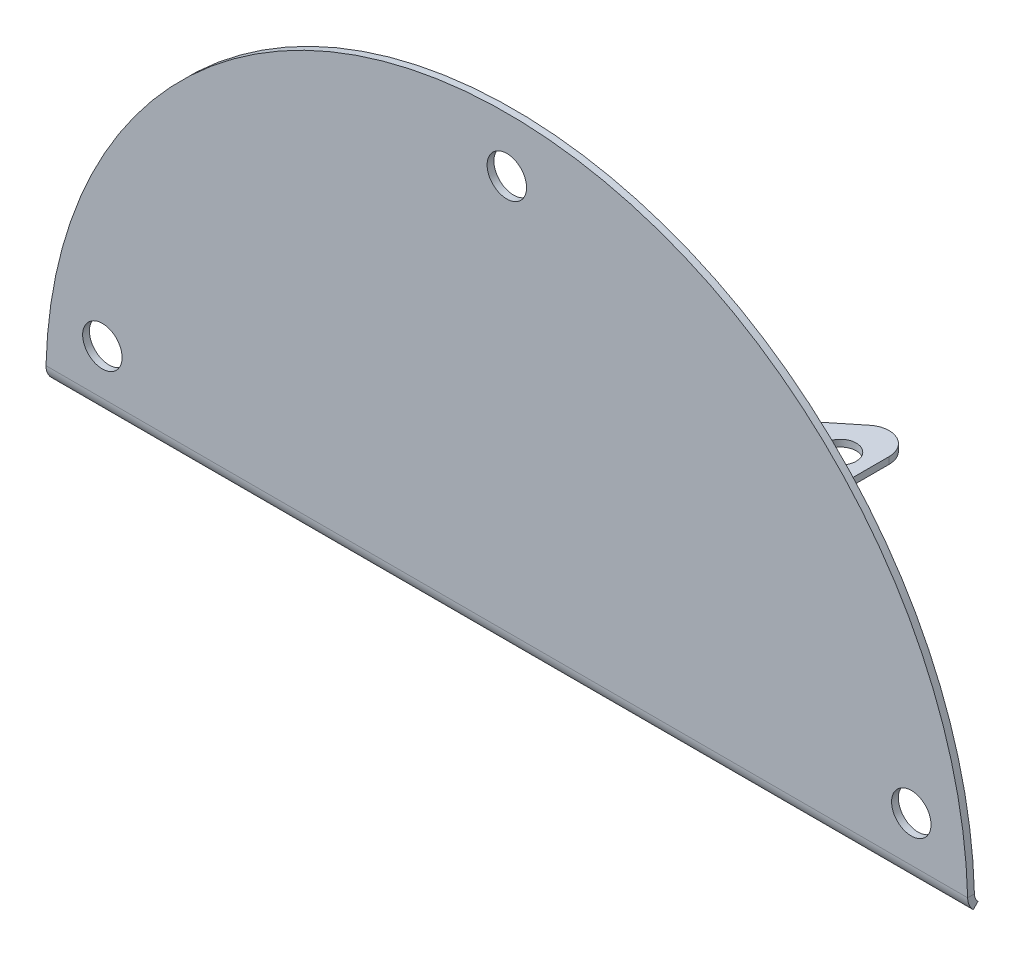
ISO-10303-21;
HEADER;
FILE_DESCRIPTION(('STEP AP214'),'2;1');
FILE_NAME('part.step','',(''),(''),'','','');
FILE_SCHEMA(('AUTOMOTIVE_DESIGN { 1 0 10303 214 1 1 1 1 }'));
ENDSEC;
DATA;
#1=APPLICATION_CONTEXT('core data for automotive mechanical design processes');
#2=APPLICATION_PROTOCOL_DEFINITION('international standard','automotive_design',2000,#1);
#3=PRODUCT_CONTEXT('',#1,'mechanical');
#4=PRODUCT('Part','Part','',(#3));
#5=PRODUCT_RELATED_PRODUCT_CATEGORY('part','',(#4));
#6=PRODUCT_DEFINITION_FORMATION('','',#4);
#7=PRODUCT_DEFINITION_CONTEXT('part definition',#1,'design');
#8=PRODUCT_DEFINITION('design','',#6,#7);
#9=PRODUCT_DEFINITION_SHAPE('','',#8);
#10=(LENGTH_UNIT() NAMED_UNIT(*) SI_UNIT(.MILLI.,.METRE.));
#11=(NAMED_UNIT(*) PLANE_ANGLE_UNIT() SI_UNIT($,.RADIAN.));
#12=(NAMED_UNIT(*) SI_UNIT($,.STERADIAN.) SOLID_ANGLE_UNIT());
#13=UNCERTAINTY_MEASURE_WITH_UNIT(LENGTH_MEASURE(1.E-05),#10,'distance_accuracy_value','');
#14=(GEOMETRIC_REPRESENTATION_CONTEXT(3) GLOBAL_UNCERTAINTY_ASSIGNED_CONTEXT((#13)) GLOBAL_UNIT_ASSIGNED_CONTEXT((#10,
#11,#12)) REPRESENTATION_CONTEXT('',''));
#15=CARTESIAN_POINT('',(0.,0.,0.));
#16=DIRECTION('',(0.,0.,1.));
#17=DIRECTION('',(1.,0.,0.));
#18=AXIS2_PLACEMENT_3D('',#15,#16,#17);
#19=CARTESIAN_POINT('',(0.,-0.0420352248333679,0.600000000000007));
#20=DIRECTION('',(0.,0.,-1.));
#21=DIRECTION('',(0.,1.,0.));
#22=AXIS2_PLACEMENT_3D('',#19,#20,#21);
#23=PLANE('',#22);
#24=DIRECTION('',(-1.,0.,0.));
#25=VECTOR('',#24,1.);
#26=CARTESIAN_POINT('',(0.,1.00000000000001,0.600000000000003));
#27=LINE('',#26,#25);
#28=CARTESIAN_POINT('',(40.8867235492184,1.00000000000001,0.600000000000003));
#29=VERTEX_POINT('',#28);
#30=CARTESIAN_POINT('',(-40.8867235492184,1.00000000000001,0.600000000000004));
#31=VERTEX_POINT('',#30);
#32=EDGE_CURVE('E135',#29,#31,#27,.T.);
#33=ORIENTED_EDGE('',*,*,#32,.F.);
#34=CARTESIAN_POINT('',(0.,-0.0420352248333679,0.600000000000007));
#35=DIRECTION('',(0.,0.,-1.));
#36=DIRECTION('',(0.,1.,0.));
#37=AXIS2_PLACEMENT_3D('',#34,#35,#36);
#38=CIRCLE('',#37,40.9);
#39=EDGE_CURVE('E391',#31,#29,#38,.T.);
#40=ORIENTED_EDGE('',*,*,#39,.F.);
#41=EDGE_LOOP('',(#33,#40));
#42=FACE_BOUND('',#41,.T.);
#43=CARTESIAN_POINT('',(0.,36.,0.59999999999988));
#44=DIRECTION('',(0.,0.,-1.));
#45=DIRECTION('',(0.,1.,0.));
#46=AXIS2_PLACEMENT_3D('',#43,#44,#45);
#47=CIRCLE('',#46,1.75);
#48=CARTESIAN_POINT('',(0.,37.75,0.599999999999874));
#49=VERTEX_POINT('',#48);
#50=EDGE_CURVE('E408',#49,#49,#47,.T.);
#51=ORIENTED_EDGE('',*,*,#50,.T.);
#52=EDGE_LOOP('',(#51));
#53=FACE_BOUND('',#52,.T.);
#54=CARTESIAN_POINT('',(-35.8867235492184,5.00000000000001,0.599999999999989));
#55=DIRECTION('',(0.,0.,-1.));
#56=DIRECTION('',(0.,1.,0.));
#57=AXIS2_PLACEMENT_3D('',#54,#55,#56);
#58=CIRCLE('',#57,1.75);
#59=CARTESIAN_POINT('',(-35.8867235492184,6.75000000000001,0.599999999999983));
#60=VERTEX_POINT('',#59);
#61=EDGE_CURVE('E644',#60,#60,#58,.T.);
#62=ORIENTED_EDGE('',*,*,#61,.T.);
#63=EDGE_LOOP('',(#62));
#64=FACE_BOUND('',#63,.T.);
#65=CARTESIAN_POINT('',(35.8867235492184,5.00000000000001,0.599999999999989));
#66=DIRECTION('',(0.,0.,-1.));
#67=DIRECTION('',(0.,1.,0.));
#68=AXIS2_PLACEMENT_3D('',#65,#66,#67);
#69=CIRCLE('',#68,1.75);
#70=CARTESIAN_POINT('',(35.8867235492184,6.75000000000001,0.599999999999983));
#71=VERTEX_POINT('',#70);
#72=EDGE_CURVE('E639',#71,#71,#69,.F.);
#73=ORIENTED_EDGE('',*,*,#72,.F.);
#74=EDGE_LOOP('',(#73));
#75=FACE_BOUND('',#74,.T.);
#76=ADVANCED_FACE('F60',(#42,#53,#64,#75),#23,.F.);
#77=CARTESIAN_POINT('',(0.,-0.04203522483337,0.));
#78=DIRECTION('',(0.,0.,-1.));
#79=DIRECTION('',(0.,1.,0.));
#80=AXIS2_PLACEMENT_3D('',#77,#78,#79);
#81=PLANE('',#80);
#82=CARTESIAN_POINT('',(0.,-0.04203522483337,0.));
#83=DIRECTION('',(0.,0.,-1.));
#84=DIRECTION('',(0.,1.,0.));
#85=AXIS2_PLACEMENT_3D('',#82,#83,#84);
#86=CIRCLE('',#85,40.9);
#87=CARTESIAN_POINT('',(-40.8867235492184,1.,0.));
#88=VERTEX_POINT('',#87);
#89=CARTESIAN_POINT('',(40.8867235492184,1.,0.));
#90=VERTEX_POINT('',#89);
#91=EDGE_CURVE('E384',#88,#90,#86,.T.);
#92=ORIENTED_EDGE('',*,*,#91,.T.);
#93=DIRECTION('',(-1.,0.,0.));
#94=VECTOR('',#93,1.);
#95=CARTESIAN_POINT('',(0.,1.,0.));
#96=LINE('',#95,#94);
#97=EDGE_CURVE('E375',#90,#88,#96,.T.);
#98=ORIENTED_EDGE('',*,*,#97,.T.);
#99=EDGE_LOOP('',(#92,#98));
#100=FACE_BOUND('',#99,.T.);
#101=CARTESIAN_POINT('',(0.,36.,-1.25693328198353E-13));
#102=DIRECTION('',(0.,0.,-1.));
#103=DIRECTION('',(0.,1.,0.));
#104=AXIS2_PLACEMENT_3D('',#101,#102,#103);
#105=CIRCLE('',#104,1.75);
#106=CARTESIAN_POINT('',(0.,37.75,-1.31803420541328E-13));
#107=VERTEX_POINT('',#106);
#108=EDGE_CURVE('E650',#107,#107,#105,.T.);
#109=ORIENTED_EDGE('',*,*,#108,.F.);
#110=EDGE_LOOP('',(#109));
#111=FACE_BOUND('',#110,.T.);
#112=CARTESIAN_POINT('',(-35.8867235492184,5.,0.));
#113=DIRECTION('',(0.,0.,-1.));
#114=DIRECTION('',(0.,1.,0.));
#115=AXIS2_PLACEMENT_3D('',#112,#113,#114);
#116=CIRCLE('',#115,1.75);
#117=CARTESIAN_POINT('',(-35.8867235492184,6.75000000000001,0.));
#118=VERTEX_POINT('',#117);
#119=EDGE_CURVE('E641',#118,#118,#116,.T.);
#120=ORIENTED_EDGE('',*,*,#119,.F.);
#121=EDGE_LOOP('',(#120));
#122=FACE_BOUND('',#121,.T.);
#123=CARTESIAN_POINT('',(35.8867235492184,5.,0.));
#124=DIRECTION('',(0.,0.,1.));
#125=DIRECTION('',(0.,1.,0.));
#126=AXIS2_PLACEMENT_3D('',#123,#124,#125);
#127=CIRCLE('',#126,1.75);
#128=CARTESIAN_POINT('',(35.8867235492184,6.75000000000001,0.));
#129=VERTEX_POINT('',#128);
#130=EDGE_CURVE('E636',#129,#129,#127,.T.);
#131=ORIENTED_EDGE('',*,*,#130,.T.);
#132=EDGE_LOOP('',(#131));
#133=FACE_BOUND('',#132,.T.);
#134=ADVANCED_FACE('F348',(#100,#111,#122,#133),#81,.T.);
#135=CARTESIAN_POINT('',(0.5,-0.6,-30.817766741711));
#136=DIRECTION('',(0.,1.,0.));
#137=DIRECTION('',(0.,0.,1.));
#138=AXIS2_PLACEMENT_3D('',#135,#136,#137);
#139=CYLINDRICAL_SURFACE('',#138,2.);
#140=CARTESIAN_POINT('',(0.5,0.,-30.817766741711));
#141=DIRECTION('',(0.,1.,0.));
#142=DIRECTION('',(0.,0.,-1.));
#143=AXIS2_PLACEMENT_3D('',#140,#141,#142);
#144=CIRCLE('',#143,2.);
#145=CARTESIAN_POINT('',(2.5,0.,-30.817766741711));
#146=VERTEX_POINT('',#145);
#147=CARTESIAN_POINT('',(-0.755504902379564,0.,-32.3745928206616));
#148=VERTEX_POINT('',#147);
#149=EDGE_CURVE('E299',#146,#148,#144,.T.);
#150=ORIENTED_EDGE('',*,*,#149,.F.);
#151=DIRECTION('',(0.,1.,0.));
#152=VECTOR('',#151,1.);
#153=CARTESIAN_POINT('',(2.5,-0.6,-30.817766741711));
#154=LINE('',#153,#152);
#155=CARTESIAN_POINT('',(2.5,-0.6,-30.817766741711));
#156=VERTEX_POINT('',#155);
#157=EDGE_CURVE('E12',#156,#146,#154,.T.);
#158=ORIENTED_EDGE('',*,*,#157,.F.);
#159=CARTESIAN_POINT('',(0.5,-0.6,-30.817766741711));
#160=DIRECTION('',(0.,1.,0.));
#161=DIRECTION('',(0.,0.,-1.));
#162=AXIS2_PLACEMENT_3D('',#159,#160,#161);
#163=CIRCLE('',#162,2.);
#164=CARTESIAN_POINT('',(-0.755504902379564,-0.6,-32.3745928206616));
#165=VERTEX_POINT('',#164);
#166=EDGE_CURVE('E307',#156,#165,#163,.T.);
#167=ORIENTED_EDGE('',*,*,#166,.T.);
#168=DIRECTION('',(0.,1.,0.));
#169=VECTOR('',#168,1.);
#170=CARTESIAN_POINT('',(-0.755504902379564,-0.6,-32.3745928206616));
#171=LINE('',#170,#169);
#172=EDGE_CURVE('E304',#165,#148,#171,.T.);
#173=ORIENTED_EDGE('',*,*,#172,.T.);
#174=EDGE_LOOP('',(#150,#158,#167,#173));
#175=FACE_BOUND('',#174,.T.);
#176=ADVANCED_FACE('F354',(#175),#139,.T.);
#177=CARTESIAN_POINT('',(0.,-0.6,0.));
#178=DIRECTION('',(0.,1.,0.));
#179=DIRECTION('',(0.,0.,1.));
#180=AXIS2_PLACEMENT_3D('',#177,#178,#179);
#181=PLANE('',#180);
#182=CARTESIAN_POINT('',(0.,-0.6,-29.));
#183=DIRECTION('',(0.,1.,0.));
#184=DIRECTION('',(0.,0.,1.));
#185=AXIS2_PLACEMENT_3D('',#182,#183,#184);
#186=CIRCLE('',#185,1.4);
#187=CARTESIAN_POINT('',(0.,-0.6,-27.6));
#188=VERTEX_POINT('',#187);
#189=EDGE_CURVE('E400',#188,#188,#186,.T.);
#190=ORIENTED_EDGE('',*,*,#189,.T.);
#191=EDGE_LOOP('',(#190));
#192=FACE_BOUND('',#191,.T.);
#193=DIRECTION('',(0.,0.,-1.));
#194=VECTOR('',#193,1.);
#195=CARTESIAN_POINT('',(2.5,-0.6,0.));
#196=LINE('',#195,#194);
#197=CARTESIAN_POINT('',(2.5,-0.6,-0.999999999999997));
#198=VERTEX_POINT('',#197);
#199=EDGE_CURVE('E72',#198,#156,#196,.T.);
#200=ORIENTED_EDGE('',*,*,#199,.F.);
#201=DIRECTION('',(-1.,0.,0.));
#202=VECTOR('',#201,1.);
#203=CARTESIAN_POINT('',(0.,-0.6,-0.999999999999997));
#204=LINE('',#203,#202);
#205=CARTESIAN_POINT('',(-39.66,-0.6,-0.999999999999998));
#206=VERTEX_POINT('',#205);
#207=EDGE_CURVE('E306',#198,#206,#204,.T.);
#208=ORIENTED_EDGE('',*,*,#207,.T.);
#209=DIRECTION('',(-0.778413039475329,0.,0.627752451189782));
#210=VECTOR('',#209,1.);
#211=CARTESIAN_POINT('',(-40.9,-0.6,0.));
#212=LINE('',#211,#210);
#213=EDGE_CURVE('E303',#165,#206,#212,.T.);
#214=ORIENTED_EDGE('',*,*,#213,.F.);
#215=ORIENTED_EDGE('',*,*,#166,.F.);
#216=EDGE_LOOP('',(#200,#208,#214,#215));
#217=FACE_BOUND('',#216,.T.);
#218=ADVANCED_FACE('F339',(#192,#217),#181,.F.);
#219=CARTESIAN_POINT('',(-40.9,-0.6,0.));
#220=DIRECTION('',(-0.627752451189782,0.,-0.778413039475329));
#221=DIRECTION('',(-0.778413039475329,0.,0.627752451189782));
#222=AXIS2_PLACEMENT_3D('',#219,#220,#221);
#223=PLANE('',#222);
#224=CARTESIAN_POINT('',(-39.66,0.,-0.999999999999998));
#225=CARTESIAN_POINT('',(-39.66,-0.6,-0.999999999999998));
#226=B_SPLINE_CURVE_WITH_KNOTS('',1,(#224,#225),.UNSPECIFIED.,.F.,.F.,(2,2),(0.,1.),.UNSPECIFIED.);
#227=CARTESIAN_POINT('',(-39.66,0.,-0.999999999999998));
#228=VERTEX_POINT('',#227);
#229=EDGE_CURVE('E185',#228,#206,#226,.T.);
#230=ORIENTED_EDGE('',*,*,#229,.F.);
#231=DIRECTION('',(-0.778413039475329,0.,0.627752451189782));
#232=VECTOR('',#231,1.);
#233=CARTESIAN_POINT('',(-40.9,0.,0.));
#234=LINE('',#233,#232);
#235=EDGE_CURVE('E298',#148,#228,#234,.T.);
#236=ORIENTED_EDGE('',*,*,#235,.F.);
#237=ORIENTED_EDGE('',*,*,#172,.F.);
#238=ORIENTED_EDGE('',*,*,#213,.T.);
#239=EDGE_LOOP('',(#230,#236,#237,#238));
#240=FACE_BOUND('',#239,.T.);
#241=ADVANCED_FACE('F329',(#240),#223,.T.);
#242=CARTESIAN_POINT('',(0.,0.,0.));
#243=DIRECTION('',(0.,1.,0.));
#244=DIRECTION('',(0.,0.,1.));
#245=AXIS2_PLACEMENT_3D('',#242,#243,#244);
#246=PLANE('',#245);
#247=CARTESIAN_POINT('',(0.,0.,-29.));
#248=DIRECTION('',(0.,1.,0.));
#249=DIRECTION('',(0.,0.,1.));
#250=AXIS2_PLACEMENT_3D('',#247,#248,#249);
#251=CIRCLE('',#250,1.4);
#252=CARTESIAN_POINT('',(0.,0.,-27.6));
#253=VERTEX_POINT('',#252);
#254=EDGE_CURVE('E403',#253,#253,#251,.T.);
#255=ORIENTED_EDGE('',*,*,#254,.F.);
#256=EDGE_LOOP('',(#255));
#257=FACE_BOUND('',#256,.T.);
#258=DIRECTION('',(-1.,0.,0.));
#259=VECTOR('',#258,1.);
#260=CARTESIAN_POINT('',(0.,0.,-0.999999999999997));
#261=LINE('',#260,#259);
#262=CARTESIAN_POINT('',(2.5,0.,-0.999999999999997));
#263=VERTEX_POINT('',#262);
#264=EDGE_CURVE('E313',#263,#228,#261,.T.);
#265=ORIENTED_EDGE('',*,*,#264,.F.);
#266=DIRECTION('',(0.,0.,-1.));
#267=VECTOR('',#266,1.);
#268=CARTESIAN_POINT('',(2.5,0.,0.));
#269=LINE('',#268,#267);
#270=EDGE_CURVE('E97',#263,#146,#269,.T.);
#271=ORIENTED_EDGE('',*,*,#270,.T.);
#272=ORIENTED_EDGE('',*,*,#149,.T.);
#273=ORIENTED_EDGE('',*,*,#235,.T.);
#274=EDGE_LOOP('',(#265,#271,#272,#273));
#275=FACE_BOUND('',#274,.T.);
#276=ADVANCED_FACE('F338',(#257,#275),#246,.T.);
#277=CARTESIAN_POINT('',(2.5,-0.6,0.));
#278=DIRECTION('',(1.,0.,0.));
#279=DIRECTION('',(0.,0.,-1.));
#280=AXIS2_PLACEMENT_3D('',#277,#278,#279);
#281=PLANE('',#280);
#282=DIRECTION('',(0.,1.,0.));
#283=VECTOR('',#282,1.);
#284=CARTESIAN_POINT('',(2.5,-0.6,-0.999999999999997));
#285=LINE('',#284,#283);
#286=EDGE_CURVE('E310',#198,#263,#285,.T.);
#287=ORIENTED_EDGE('',*,*,#286,.F.);
#288=ORIENTED_EDGE('',*,*,#199,.T.);
#289=ORIENTED_EDGE('',*,*,#157,.T.);
#290=ORIENTED_EDGE('',*,*,#270,.F.);
#291=EDGE_LOOP('',(#287,#288,#289,#290));
#292=FACE_BOUND('',#291,.T.);
#293=ADVANCED_FACE('F62',(#292),#281,.T.);
#294=CARTESIAN_POINT('',(40.9,-0.149513513285818,0.112932469996856));
#295=CARTESIAN_POINT('',(40.89778682558,-0.000803054612772406,0.26653090154597));
#296=CARTESIAN_POINT('',(40.8955745164061,0.178964943287356,0.389816839267624));
#297=CARTESIAN_POINT('',(40.8911490328122,0.572589584931808,0.556601987713694));
#298=CARTESIAN_POINT('',(40.8889367236384,0.786207393268396,0.600000000000003));
#299=CARTESIAN_POINT('',(40.8867235492184,1.,0.600000000000003));
#300=CARTESIAN_POINT('',(40.9,0.281554054196364,-0.304417206251963));
#301=CARTESIAN_POINT('',(40.8977868256523,0.374498087830562,-0.208418189670029));
#302=CARTESIAN_POINT('',(40.8955745164061,0.486853089554597,-0.131364475457734));
#303=CARTESIAN_POINT('',(40.8911490328122,0.73286849058238,-0.0271237576789403));
#304=CARTESIAN_POINT('',(40.8889367235661,0.866379625158088,0.));
#305=CARTESIAN_POINT('',(40.8867235492184,1.,0.));
#306=B_SPLINE_SURFACE_WITH_KNOTS('',1,3,((#294,#295,#296,#297,#298,#299),(#300,#301,#302,#303,
#304,#305)),.UNSPECIFIED.,.F.,.F.,.F.,(2,2),(4,2,4),(0.,1.),(0.,0.5,1.),.UNSPECIFIED.);
#307=CARTESIAN_POINT('',(40.9,-0.149513513285818,0.112932469996856));
#308=CARTESIAN_POINT('',(40.9,0.281554054196364,-0.304417206251963));
#309=B_SPLINE_CURVE_WITH_KNOTS('',1,(#307,#308),.UNSPECIFIED.,.F.,.F.,(2,2),(0.,1.),.UNSPECIFIED.);
#310=CARTESIAN_POINT('',(40.9,0.281554054196364,-0.304417206251963));
#311=VERTEX_POINT('',#310);
#312=CARTESIAN_POINT('',(40.9,-0.149513513285818,0.112932469996856));
#313=VERTEX_POINT('',#312);
#314=EDGE_CURVE('E126',#311,#313,#309,.F.);
#315=CARTESIAN_POINT('',(40.9,0.281554054196364,-0.304417206251963));
#316=CARTESIAN_POINT('',(40.8977868256523,0.374498087830562,-0.208418189670029));
#317=CARTESIAN_POINT('',(40.8955745164061,0.486853089554597,-0.131364475457734));
#318=CARTESIAN_POINT('',(40.8911490328122,0.73286849058238,-0.0271237576789403));
#319=CARTESIAN_POINT('',(40.8889367235661,0.866379625158088,0.));
#320=CARTESIAN_POINT('',(40.8867235492184,1.,0.));
#321=B_SPLINE_CURVE_WITH_KNOTS('',3,(#315,#316,#317,#318,#319,#320),.UNSPECIFIED.,.F.,.F.,(4,2,
4),(0.,0.5,1.),.UNSPECIFIED.);
#322=EDGE_CURVE('E383',#311,#90,#321,.T.);
#323=CARTESIAN_POINT('',(40.8867235492184,1.,0.));
#324=CARTESIAN_POINT('',(40.8867235492184,1.,0.600000000000003));
#325=B_SPLINE_CURVE_WITH_KNOTS('',1,(#323,#324),.UNSPECIFIED.,.F.,.F.,(2,2),(0.,1.),.UNSPECIFIED.);
#326=EDGE_CURVE('E388',#29,#90,#325,.F.);
#327=CARTESIAN_POINT('',(40.8867235492184,1.,0.600000000000003));
#328=CARTESIAN_POINT('',(40.8889367236384,0.786207393268396,0.600000000000003));
#329=CARTESIAN_POINT('',(40.8911490328122,0.572589584931808,0.556601987713694));
#330=CARTESIAN_POINT('',(40.8955745164061,0.178964943287356,0.389816839267624));
#331=CARTESIAN_POINT('',(40.89778682558,-0.000803054612772406,0.26653090154597));
#332=CARTESIAN_POINT('',(40.9,-0.149513513285818,0.112932469996856));
#333=B_SPLINE_CURVE_WITH_KNOTS('',3,(#327,#328,#329,#330,#331,#332),.UNSPECIFIED.,.F.,.F.,(4,2,
4),(0.,0.5,1.),.UNSPECIFIED.);
#334=EDGE_CURVE('E177',#313,#29,#333,.F.);
#335=ORIENTED_EDGE('',*,*,#314,.F.);
#336=ORIENTED_EDGE('',*,*,#322,.T.);
#337=ORIENTED_EDGE('',*,*,#326,.F.);
#338=ORIENTED_EDGE('',*,*,#334,.F.);
#339=EDGE_LOOP('',(#335,#336,#337,#338));
#340=FACE_BOUND('',#339,.T.);
#341=ADVANCED_FACE('F238',(#340),#306,.T.);
#342=CARTESIAN_POINT('',(-40.8867235492184,1.,0.600000000000003));
#343=CARTESIAN_POINT('',(-40.8889367236384,0.786207393268393,0.600000000000003));
#344=CARTESIAN_POINT('',(-40.8911490328122,0.572589584931805,0.556601987713693));
#345=CARTESIAN_POINT('',(-40.8955745164061,0.178964943287349,0.389816839267621));
#346=CARTESIAN_POINT('',(-40.89778682558,-0.000803054612781297,0.266530901545963));
#347=CARTESIAN_POINT('',(-40.9,-0.149513513285826,0.112932469996847));
#348=CARTESIAN_POINT('',(-40.8867235492184,1.,0.));
#349=CARTESIAN_POINT('',(-40.8889367235661,0.866379625158086,0.));
#350=CARTESIAN_POINT('',(-40.8911490328122,0.732868490582378,-0.0271237576789407));
#351=CARTESIAN_POINT('',(-40.8955745164061,0.486853089554593,-0.131364475457736));
#352=CARTESIAN_POINT('',(-40.8977868256523,0.374498087830556,-0.208418189670033));
#353=CARTESIAN_POINT('',(-40.9,0.281554054196358,-0.304417206251969));
#354=B_SPLINE_SURFACE_WITH_KNOTS('',1,3,((#342,#343,#344,#345,#346,#347),(#348,#349,#350,#351,
#352,#353)),.UNSPECIFIED.,.F.,.F.,.F.,(2,2),(4,2,4),(0.,1.),(0.,0.5,1.),.UNSPECIFIED.);
#355=CARTESIAN_POINT('',(-40.8867235492184,1.,0.600000000000003));
#356=CARTESIAN_POINT('',(-40.8867235492184,1.,0.));
#357=B_SPLINE_CURVE_WITH_KNOTS('',1,(#355,#356),.UNSPECIFIED.,.F.,.F.,(2,2),(0.,1.),.UNSPECIFIED.);
#358=EDGE_CURVE('E390',#88,#31,#357,.F.);
#359=CARTESIAN_POINT('',(-40.8867235492184,1.,0.));
#360=CARTESIAN_POINT('',(-40.8889367235661,0.866379625158086,0.));
#361=CARTESIAN_POINT('',(-40.8911490328122,0.732868490582378,-0.0271237576789407));
#362=CARTESIAN_POINT('',(-40.8955745164061,0.486853089554593,-0.131364475457736));
#363=CARTESIAN_POINT('',(-40.8977868256523,0.374498087830556,-0.208418189670033));
#364=CARTESIAN_POINT('',(-40.9,0.281554054196358,-0.304417206251969));
#365=B_SPLINE_CURVE_WITH_KNOTS('',3,(#359,#360,#361,#362,#363,#364),.UNSPECIFIED.,.F.,.F.,(4,2,
4),(0.,0.5,1.),.UNSPECIFIED.);
#366=CARTESIAN_POINT('',(-40.9,0.281554054196358,-0.304417206251969));
#367=VERTEX_POINT('',#366);
#368=EDGE_CURVE('E159',#88,#367,#365,.T.);
#369=CARTESIAN_POINT('',(-40.9,0.281554054196358,-0.304417206251969));
#370=CARTESIAN_POINT('',(-40.9,-0.149513513285826,0.112932469996847));
#371=B_SPLINE_CURVE_WITH_KNOTS('',1,(#369,#370),.UNSPECIFIED.,.F.,.F.,(2,2),(0.,1.),.UNSPECIFIED.);
#372=CARTESIAN_POINT('',(-40.9,-0.149513513285826,0.112932469996847));
#373=VERTEX_POINT('',#372);
#374=EDGE_CURVE('E151',#367,#373,#371,.T.);
#375=CARTESIAN_POINT('',(-40.9,-0.149513513285826,0.112932469996847));
#376=CARTESIAN_POINT('',(-40.89778682558,-0.000803054612781297,0.266530901545963));
#377=CARTESIAN_POINT('',(-40.8955745164061,0.178964943287349,0.389816839267621));
#378=CARTESIAN_POINT('',(-40.8911490328122,0.572589584931805,0.556601987713693));
#379=CARTESIAN_POINT('',(-40.8889367236384,0.786207393268393,0.600000000000003));
#380=CARTESIAN_POINT('',(-40.8867235492184,1.,0.600000000000003));
#381=B_SPLINE_CURVE_WITH_KNOTS('',3,(#375,#376,#377,#378,#379,#380),.UNSPECIFIED.,.F.,.F.,(4,2,
4),(0.,0.5,1.),.UNSPECIFIED.);
#382=EDGE_CURVE('E156',#31,#373,#381,.F.);
#383=ORIENTED_EDGE('',*,*,#358,.F.);
#384=ORIENTED_EDGE('',*,*,#368,.T.);
#385=ORIENTED_EDGE('',*,*,#374,.T.);
#386=ORIENTED_EDGE('',*,*,#382,.F.);
#387=EDGE_LOOP('',(#383,#384,#385,#386));
#388=FACE_BOUND('',#387,.T.);
#389=ADVANCED_FACE('F155',(#388),#354,.T.);
#390=CARTESIAN_POINT('',(-40.9,-0.149513513285821,0.112932469996853));
#391=CARTESIAN_POINT('',(-40.6933163118829,-0.292208914975817,-0.0344531953048908));
#392=CARTESIAN_POINT('',(-40.4866666666667,-0.406143850153705,-0.209533648272086));
#393=CARTESIAN_POINT('',(-40.0733333333333,-0.560073141658362,-0.58981787799158));
#394=CARTESIAN_POINT('',(-39.8666836881172,-0.6,-0.794854900131852));
#395=CARTESIAN_POINT('',(-39.66,-0.6,-0.999999999999998));
#396=CARTESIAN_POINT('',(-40.9,0.281554054196362,-0.304417206251965));
#397=CARTESIAN_POINT('',(-40.6933238019284,0.192372660117027,-0.396529908856602));
#398=CARTESIAN_POINT('',(-40.4866666666667,0.121160093653935,-0.505958530170052));
#399=CARTESIAN_POINT('',(-40.0733333333333,0.024954286463524,-0.743636173744736));
#400=CARTESIAN_POINT('',(-39.8666761980716,0.,-0.871788959012624));
#401=CARTESIAN_POINT('',(-39.66,0.,-0.999999999999998));
#402=B_SPLINE_SURFACE_WITH_KNOTS('',1,3,((#390,#391,#392,#393,#394,#395),(#396,#397,#398,#399,
#400,#401)),.UNSPECIFIED.,.F.,.F.,.F.,(2,2),(4,2,4),(0.,1.),(0.,0.5,1.),.UNSPECIFIED.);
#403=CARTESIAN_POINT('',(-40.9,0.281554054196362,-0.304417206251965));
#404=CARTESIAN_POINT('',(-40.6933238019284,0.192372660117027,-0.396529908856602));
#405=CARTESIAN_POINT('',(-40.4866666666667,0.121160093653935,-0.505958530170052));
#406=CARTESIAN_POINT('',(-40.0733333333333,0.024954286463524,-0.743636173744736));
#407=CARTESIAN_POINT('',(-39.8666761980716,0.,-0.871788959012624));
#408=CARTESIAN_POINT('',(-39.66,0.,-0.999999999999998));
#409=B_SPLINE_CURVE_WITH_KNOTS('',3,(#403,#404,#405,#406,#407,#408),.UNSPECIFIED.,.F.,.F.,(4,2,
4),(0.,0.5,1.),.UNSPECIFIED.);
#410=EDGE_CURVE('E416',#367,#228,#409,.T.);
#411=CARTESIAN_POINT('',(-39.66,-0.6,-0.999999999999998));
#412=CARTESIAN_POINT('',(-39.8666836881172,-0.6,-0.794854900131852));
#413=CARTESIAN_POINT('',(-40.0733333333333,-0.560073141658362,-0.58981787799158));
#414=CARTESIAN_POINT('',(-40.4866666666667,-0.406143850153705,-0.209533648272086));
#415=CARTESIAN_POINT('',(-40.6933163118829,-0.292208914975817,-0.0344531953048908));
#416=CARTESIAN_POINT('',(-40.9,-0.149513513285821,0.112932469996853));
#417=B_SPLINE_CURVE_WITH_KNOTS('',3,(#411,#412,#413,#414,#415,#416),.UNSPECIFIED.,.F.,.F.,(4,2,
4),(0.,0.5,1.),.UNSPECIFIED.);
#418=EDGE_CURVE('E173',#373,#206,#417,.F.);
#419=ORIENTED_EDGE('',*,*,#374,.F.);
#420=ORIENTED_EDGE('',*,*,#410,.T.);
#421=ORIENTED_EDGE('',*,*,#229,.T.);
#422=ORIENTED_EDGE('',*,*,#418,.F.);
#423=EDGE_LOOP('',(#419,#420,#421,#422));
#424=FACE_BOUND('',#423,.T.);
#425=ADVANCED_FACE('F183',(#424),#402,.T.);
#426=CARTESIAN_POINT('',(2.5,1.,-0.999999999999997));
#427=DIRECTION('',(1.,0.,0.));
#428=DIRECTION('',(0.,0.,-1.));
#429=AXIS2_PLACEMENT_3D('',#426,#427,#428);
#430=PLANE('',#429);
#431=ORIENTED_EDGE('',*,*,#286,.T.);
#432=CARTESIAN_POINT('',(2.5,1.,-0.999999999999997));
#433=DIRECTION('',(-1.,0.,0.));
#434=DIRECTION('',(0.,0.,1.));
#435=AXIS2_PLACEMENT_3D('',#432,#433,#434);
#436=CIRCLE('',#435,1.);
#437=CARTESIAN_POINT('',(2.5,0.281554054196362,-0.304417206251965));
#438=VERTEX_POINT('',#437);
#439=EDGE_CURVE('E413',#263,#438,#436,.T.);
#440=ORIENTED_EDGE('',*,*,#439,.T.);
#441=DIRECTION('',(0.,-0.718445945803637,0.695582793748032));
#442=VECTOR('',#441,1.);
#443=CARTESIAN_POINT('',(2.5,-0.14951351328582,0.112932469996854));
#444=LINE('',#443,#442);
#445=CARTESIAN_POINT('',(2.5,-0.14951351328582,0.112932469996854));
#446=VERTEX_POINT('',#445);
#447=EDGE_CURVE('E110',#438,#446,#444,.T.);
#448=ORIENTED_EDGE('',*,*,#447,.T.);
#449=CARTESIAN_POINT('',(2.5,1.,-0.999999999999997));
#450=DIRECTION('',(-1.,0.,0.));
#451=DIRECTION('',(0.,0.,-1.));
#452=AXIS2_PLACEMENT_3D('',#449,#450,#451);
#453=CIRCLE('',#452,1.6);
#454=EDGE_CURVE('E188',#198,#446,#453,.T.);
#455=ORIENTED_EDGE('',*,*,#454,.F.);
#456=EDGE_LOOP('',(#431,#440,#448,#455));
#457=FACE_BOUND('',#456,.T.);
#458=ADVANCED_FACE('F210',(#457),#430,.T.);
#459=CARTESIAN_POINT('',(21.7,-0.14951351328582,0.112932469996854));
#460=DIRECTION('',(0.,-0.695582793748032,-0.718445945803637));
#461=DIRECTION('',(1.,0.,0.));
#462=AXIS2_PLACEMENT_3D('',#459,#460,#461);
#463=PLANE('',#462);
#464=DIRECTION('',(-1.,0.,0.));
#465=VECTOR('',#464,1.);
#466=CARTESIAN_POINT('',(63.2476842386454,0.281554054196362,-0.304417206251965));
#467=LINE('',#466,#465);
#468=EDGE_CURVE('E415',#438,#311,#467,.F.);
#469=ORIENTED_EDGE('',*,*,#468,.T.);
#470=ORIENTED_EDGE('',*,*,#314,.T.);
#471=DIRECTION('',(1.,0.,0.));
#472=VECTOR('',#471,1.);
#473=CARTESIAN_POINT('',(40.9,-0.14951351328582,0.112932469996854));
#474=LINE('',#473,#472);
#475=EDGE_CURVE('E295',#446,#313,#474,.T.);
#476=ORIENTED_EDGE('',*,*,#475,.F.);
#477=ORIENTED_EDGE('',*,*,#447,.F.);
#478=EDGE_LOOP('',(#469,#470,#476,#477));
#479=FACE_BOUND('',#478,.T.);
#480=ADVANCED_FACE('F249',(#479),#463,.T.);
#481=CARTESIAN_POINT('',(63.2476842386454,1.,-0.999999999999997));
#482=DIRECTION('',(-1.,0.,0.));
#483=DIRECTION('',(0.,0.,1.));
#484=AXIS2_PLACEMENT_3D('',#481,#482,#483);
#485=CYLINDRICAL_SURFACE('',#484,1.6);
#486=ORIENTED_EDGE('',*,*,#454,.T.);
#487=ORIENTED_EDGE('',*,*,#475,.T.);
#488=ORIENTED_EDGE('',*,*,#334,.T.);
#489=ORIENTED_EDGE('',*,*,#32,.T.);
#490=ORIENTED_EDGE('',*,*,#382,.T.);
#491=ORIENTED_EDGE('',*,*,#418,.T.);
#492=ORIENTED_EDGE('',*,*,#207,.F.);
#493=EDGE_LOOP('',(#486,#487,#488,#489,#490,#491,#492));
#494=FACE_BOUND('',#493,.T.);
#495=ADVANCED_FACE('F171',(#494),#485,.T.);
#496=CARTESIAN_POINT('',(63.2476842386454,1.,-0.999999999999997));
#497=DIRECTION('',(-1.,0.,0.));
#498=DIRECTION('',(0.,0.,1.));
#499=AXIS2_PLACEMENT_3D('',#496,#497,#498);
#500=CYLINDRICAL_SURFACE('',#499,1.);
#501=ORIENTED_EDGE('',*,*,#439,.F.);
#502=ORIENTED_EDGE('',*,*,#264,.T.);
#503=ORIENTED_EDGE('',*,*,#410,.F.);
#504=ORIENTED_EDGE('',*,*,#368,.F.);
#505=ORIENTED_EDGE('',*,*,#97,.F.);
#506=ORIENTED_EDGE('',*,*,#322,.F.);
#507=ORIENTED_EDGE('',*,*,#468,.F.);
#508=EDGE_LOOP('',(#501,#502,#503,#504,#505,#506,#507));
#509=FACE_BOUND('',#508,.T.);
#510=ADVANCED_FACE('F364',(#509),#500,.F.);
#511=CARTESIAN_POINT('',(0.,-0.0420352248333679,0.600000000000007));
#512=DIRECTION('',(0.,0.,-1.));
#513=DIRECTION('',(0.,1.,0.));
#514=AXIS2_PLACEMENT_3D('',#511,#512,#513);
#515=CYLINDRICAL_SURFACE('',#514,40.9);
#516=ORIENTED_EDGE('',*,*,#91,.F.);
#517=ORIENTED_EDGE('',*,*,#358,.T.);
#518=ORIENTED_EDGE('',*,*,#39,.T.);
#519=ORIENTED_EDGE('',*,*,#326,.T.);
#520=EDGE_LOOP('',(#516,#517,#518,#519));
#521=FACE_BOUND('',#520,.T.);
#522=ADVANCED_FACE('F361',(#521),#515,.T.);
#523=CARTESIAN_POINT('',(0.,-10.,-29.));
#524=DIRECTION('',(0.,1.,0.));
#525=DIRECTION('',(0.,0.,1.));
#526=AXIS2_PLACEMENT_3D('',#523,#524,#525);
#527=CYLINDRICAL_SURFACE('',#526,1.4);
#528=ORIENTED_EDGE('',*,*,#254,.T.);
#529=EDGE_LOOP('',(#528));
#530=FACE_BOUND('',#529,.T.);
#531=ORIENTED_EDGE('',*,*,#189,.F.);
#532=EDGE_LOOP('',(#531));
#533=FACE_BOUND('',#532,.T.);
#534=ADVANCED_FACE('F359',(#530,#533),#527,.F.);
#535=CARTESIAN_POINT('',(0.,36.,9.99999999999988));
#536=DIRECTION('',(0.,0.,-1.));
#537=DIRECTION('',(0.,1.,0.));
#538=AXIS2_PLACEMENT_3D('',#535,#536,#537);
#539=CYLINDRICAL_SURFACE('',#538,1.75);
#540=ORIENTED_EDGE('',*,*,#108,.T.);
#541=EDGE_LOOP('',(#540));
#542=FACE_BOUND('',#541,.T.);
#543=ORIENTED_EDGE('',*,*,#50,.F.);
#544=EDGE_LOOP('',(#543));
#545=FACE_BOUND('',#544,.T.);
#546=ADVANCED_FACE('F483',(#542,#545),#539,.F.);
#547=CARTESIAN_POINT('',(-35.8867235492184,5.00000000000004,9.99999999999998));
#548=DIRECTION('',(0.,0.,-1.));
#549=DIRECTION('',(0.,1.,0.));
#550=AXIS2_PLACEMENT_3D('',#547,#548,#549);
#551=CYLINDRICAL_SURFACE('',#550,1.75);
#552=ORIENTED_EDGE('',*,*,#119,.T.);
#553=EDGE_LOOP('',(#552));
#554=FACE_BOUND('',#553,.T.);
#555=ORIENTED_EDGE('',*,*,#61,.F.);
#556=EDGE_LOOP('',(#555));
#557=FACE_BOUND('',#556,.T.);
#558=ADVANCED_FACE('F503',(#554,#557),#551,.F.);
#559=CARTESIAN_POINT('',(35.8867235492184,5.00000000000004,9.99999999999998));
#560=DIRECTION('',(0.,0.,-1.));
#561=DIRECTION('',(0.,1.,0.));
#562=AXIS2_PLACEMENT_3D('',#559,#560,#561);
#563=CYLINDRICAL_SURFACE('',#562,1.75);
#564=ORIENTED_EDGE('',*,*,#130,.F.);
#565=EDGE_LOOP('',(#564));
#566=FACE_BOUND('',#565,.T.);
#567=ORIENTED_EDGE('',*,*,#72,.T.);
#568=EDGE_LOOP('',(#567));
#569=FACE_BOUND('',#568,.T.);
#570=ADVANCED_FACE('F509',(#566,#569),#563,.F.);
#571=CLOSED_SHELL('',(#76,#134,#176,#218,#241,#276,#293,#341,#389,#425,#458,#480,#495,#510,#522,
#534,#546,#558,#570));
#572=MANIFOLD_SOLID_BREP('B2',#571);
#573=ADVANCED_BREP_SHAPE_REPRESENTATION('',(#18,#572),#14);
#574=SHAPE_DEFINITION_REPRESENTATION(#9,#573);
ENDSEC;
END-ISO-10303-21;
